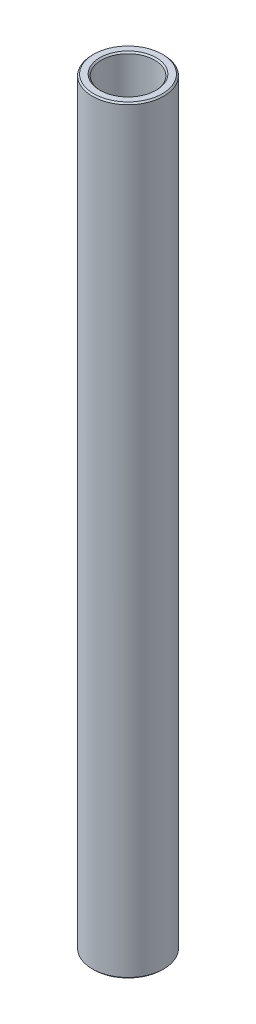
ISO-10303-21;
HEADER;
FILE_DESCRIPTION(('STEP AP214'),'2;1');
FILE_NAME('part.step','',(''),(''),'','','');
FILE_SCHEMA(('AUTOMOTIVE_DESIGN { 1 0 10303 214 1 1 1 1 }'));
ENDSEC;
DATA;
#1=APPLICATION_CONTEXT('core data for automotive mechanical design processes');
#2=APPLICATION_PROTOCOL_DEFINITION('international standard','automotive_design',2000,#1);
#3=PRODUCT_CONTEXT('',#1,'mechanical');
#4=PRODUCT('Part','Part','',(#3));
#5=PRODUCT_RELATED_PRODUCT_CATEGORY('part','',(#4));
#6=PRODUCT_DEFINITION_FORMATION('','',#4);
#7=PRODUCT_DEFINITION_CONTEXT('part definition',#1,'design');
#8=PRODUCT_DEFINITION('design','',#6,#7);
#9=PRODUCT_DEFINITION_SHAPE('','',#8);
#10=(LENGTH_UNIT() NAMED_UNIT(*) SI_UNIT(.MILLI.,.METRE.));
#11=(NAMED_UNIT(*) PLANE_ANGLE_UNIT() SI_UNIT($,.RADIAN.));
#12=(NAMED_UNIT(*) SI_UNIT($,.STERADIAN.) SOLID_ANGLE_UNIT());
#13=UNCERTAINTY_MEASURE_WITH_UNIT(LENGTH_MEASURE(1.E-05),#10,'distance_accuracy_value','');
#14=(GEOMETRIC_REPRESENTATION_CONTEXT(3) GLOBAL_UNCERTAINTY_ASSIGNED_CONTEXT((#13)) GLOBAL_UNIT_ASSIGNED_CONTEXT((#10,
#11,#12)) REPRESENTATION_CONTEXT('',''));
#15=CARTESIAN_POINT('',(0.,0.,0.));
#16=DIRECTION('',(0.,0.,1.));
#17=DIRECTION('',(1.,0.,0.));
#18=AXIS2_PLACEMENT_3D('',#15,#16,#17);
#19=CARTESIAN_POINT('',(6.35000000000028,131.762389929627,0.));
#20=DIRECTION('',(0.,-1.,0.));
#21=DIRECTION('',(1.,0.,0.));
#22=AXIS2_PLACEMENT_3D('',#19,#20,#21);
#23=PLANE('',#22);
#24=CARTESIAN_POINT('',(0.,131.762389929627,0.));
#25=DIRECTION('',(0.,-1.,0.));
#26=DIRECTION('',(1.,0.,0.));
#27=AXIS2_PLACEMENT_3D('',#24,#25,#26);
#28=CIRCLE('',#27,5.01649999999998);
#29=CARTESIAN_POINT('',(5.01649999999997,131.762389929627,0.));
#30=VERTEX_POINT('',#29);
#31=EDGE_CURVE('E10',#30,#30,#28,.F.);
#32=ORIENTED_EDGE('',*,*,#31,.T.);
#33=EDGE_LOOP('',(#32));
#34=FACE_BOUND('',#33,.T.);
#35=CARTESIAN_POINT('',(0.,131.762389929627,0.));
#36=DIRECTION('',(0.,-1.,0.));
#37=DIRECTION('',(1.,0.,0.));
#38=AXIS2_PLACEMENT_3D('',#35,#36,#37);
#39=CIRCLE('',#38,6.09600000000031);
#40=CARTESIAN_POINT('',(6.0960000000003,131.762389929627,0.));
#41=VERTEX_POINT('',#40);
#42=EDGE_CURVE('E37',#41,#41,#39,.T.);
#43=ORIENTED_EDGE('',*,*,#42,.T.);
#44=EDGE_LOOP('',(#43));
#45=FACE_BOUND('',#44,.T.);
#46=ADVANCED_FACE('F30',(#34,#45),#23,.T.);
#47=CARTESIAN_POINT('',(0.,122.237389929627,0.));
#48=DIRECTION('',(0.,-1.,0.));
#49=DIRECTION('',(1.,0.,0.));
#50=AXIS2_PLACEMENT_3D('',#47,#48,#49);
#51=CYLINDRICAL_SURFACE('',#50,4.76250000000011);
#52=CARTESIAN_POINT('',(-1.81950710277241E-13,266.446336963922,0.));
#53=DIRECTION('',(0.,1.,0.));
#54=DIRECTION('',(-1.,0.,0.));
#55=AXIS2_PLACEMENT_3D('',#52,#53,#54);
#56=CIRCLE('',#55,4.76250000000011);
#57=CARTESIAN_POINT('',(-4.76250000000029,266.446336963922,0.));
#58=VERTEX_POINT('',#57);
#59=EDGE_CURVE('E41',#58,#58,#56,.T.);
#60=ORIENTED_EDGE('',*,*,#59,.T.);
#61=EDGE_LOOP('',(#60));
#62=FACE_BOUND('',#61,.T.);
#63=CARTESIAN_POINT('',(0.,132.016389929627,0.));
#64=DIRECTION('',(0.,-1.,0.));
#65=DIRECTION('',(1.,0.,0.));
#66=AXIS2_PLACEMENT_3D('',#63,#64,#65);
#67=CIRCLE('',#66,4.76250000000011);
#68=CARTESIAN_POINT('',(4.7625000000001,132.016389929627,0.));
#69=VERTEX_POINT('',#68);
#70=EDGE_CURVE('E45',#69,#69,#67,.T.);
#71=ORIENTED_EDGE('',*,*,#70,.T.);
#72=EDGE_LOOP('',(#71));
#73=FACE_BOUND('',#72,.T.);
#74=ADVANCED_FACE('F74',(#62,#73),#51,.F.);
#75=CARTESIAN_POINT('',(4.76250000000001,266.700336963923,0.));
#76=DIRECTION('',(0.,1.,0.));
#77=DIRECTION('',(-1.,0.,0.));
#78=AXIS2_PLACEMENT_3D('',#75,#76,#77);
#79=PLANE('',#78);
#80=CARTESIAN_POINT('',(-1.82271186096259E-13,266.700336963923,0.));
#81=DIRECTION('',(0.,1.,0.));
#82=DIRECTION('',(-1.,0.,0.));
#83=AXIS2_PLACEMENT_3D('',#80,#81,#82);
#84=CIRCLE('',#83,6.09600000000047);
#85=CARTESIAN_POINT('',(-6.09600000000066,266.700336963923,0.));
#86=VERTEX_POINT('',#85);
#87=EDGE_CURVE('E50',#86,#86,#84,.T.);
#88=ORIENTED_EDGE('',*,*,#87,.T.);
#89=EDGE_LOOP('',(#88));
#90=FACE_BOUND('',#89,.T.);
#91=CARTESIAN_POINT('',(-1.82271186096259E-13,266.700336963923,0.));
#92=DIRECTION('',(0.,1.,0.));
#93=DIRECTION('',(-1.,0.,0.));
#94=AXIS2_PLACEMENT_3D('',#91,#92,#93);
#95=CIRCLE('',#94,5.01650000000016);
#96=CARTESIAN_POINT('',(-5.01650000000034,266.700336963923,0.));
#97=VERTEX_POINT('',#96);
#98=EDGE_CURVE('E53',#97,#97,#95,.F.);
#99=ORIENTED_EDGE('',*,*,#98,.T.);
#100=EDGE_LOOP('',(#99));
#101=FACE_BOUND('',#100,.T.);
#102=ADVANCED_FACE('F79',(#90,#101),#79,.T.);
#103=CARTESIAN_POINT('',(0.,122.237389929627,0.));
#104=DIRECTION('',(0.,-1.,0.));
#105=DIRECTION('',(1.,0.,0.));
#106=AXIS2_PLACEMENT_3D('',#103,#104,#105);
#107=CYLINDRICAL_SURFACE('',#106,6.35000000000038);
#108=CARTESIAN_POINT('',(-1.81950710277242E-13,266.446336963923,0.));
#109=DIRECTION('',(0.,1.,0.));
#110=DIRECTION('',(-1.,0.,0.));
#111=AXIS2_PLACEMENT_3D('',#108,#109,#110);
#112=CIRCLE('',#111,6.35000000000038);
#113=CARTESIAN_POINT('',(-6.35000000000056,266.446336963923,0.));
#114=VERTEX_POINT('',#113);
#115=EDGE_CURVE('E56',#114,#114,#112,.F.);
#116=ORIENTED_EDGE('',*,*,#115,.T.);
#117=EDGE_LOOP('',(#116));
#118=FACE_BOUND('',#117,.T.);
#119=CARTESIAN_POINT('',(0.,132.016389929627,0.));
#120=DIRECTION('',(0.,-1.,0.));
#121=DIRECTION('',(1.,0.,0.));
#122=AXIS2_PLACEMENT_3D('',#119,#120,#121);
#123=CIRCLE('',#122,6.35000000000038);
#124=CARTESIAN_POINT('',(6.35000000000037,132.016389929627,0.));
#125=VERTEX_POINT('',#124);
#126=EDGE_CURVE('E59',#125,#125,#123,.F.);
#127=ORIENTED_EDGE('',*,*,#126,.T.);
#128=EDGE_LOOP('',(#127));
#129=FACE_BOUND('',#128,.T.);
#130=ADVANCED_FACE('F63',(#118,#129),#107,.T.);
#131=CARTESIAN_POINT('',(-1.81950710277242E-13,266.446336963923,0.));
#132=DIRECTION('',(0.,-1.,0.));
#133=DIRECTION('',(1.,0.,0.));
#134=AXIS2_PLACEMENT_3D('',#131,#132,#133);
#135=CONICAL_SURFACE('',#134,6.35000000000038,0.785398163397426);
#136=ORIENTED_EDGE('',*,*,#87,.F.);
#137=EDGE_LOOP('',(#136));
#138=FACE_BOUND('',#137,.T.);
#139=ORIENTED_EDGE('',*,*,#115,.F.);
#140=EDGE_LOOP('',(#139));
#141=FACE_BOUND('',#140,.T.);
#142=ADVANCED_FACE('F84',(#138,#141),#135,.T.);
#143=CARTESIAN_POINT('',(-1.82271186096259E-13,266.700336963923,0.));
#144=DIRECTION('',(0.,1.,0.));
#145=DIRECTION('',(-1.,0.,0.));
#146=AXIS2_PLACEMENT_3D('',#143,#144,#145);
#147=CONICAL_SURFACE('',#146,5.01650000000017,0.785398163397389);
#148=ORIENTED_EDGE('',*,*,#59,.F.);
#149=EDGE_LOOP('',(#148));
#150=FACE_BOUND('',#149,.T.);
#151=ORIENTED_EDGE('',*,*,#98,.F.);
#152=EDGE_LOOP('',(#151));
#153=FACE_BOUND('',#152,.T.);
#154=ADVANCED_FACE('F71',(#150,#153),#147,.F.);
#155=CARTESIAN_POINT('',(0.,132.016389929627,0.));
#156=DIRECTION('',(0.,-1.,0.));
#157=DIRECTION('',(1.,0.,0.));
#158=AXIS2_PLACEMENT_3D('',#155,#156,#157);
#159=CONICAL_SURFACE('',#158,4.76250000000011,0.785398163397389);
#160=ORIENTED_EDGE('',*,*,#31,.F.);
#161=EDGE_LOOP('',(#160));
#162=FACE_BOUND('',#161,.T.);
#163=ORIENTED_EDGE('',*,*,#70,.F.);
#164=EDGE_LOOP('',(#163));
#165=FACE_BOUND('',#164,.T.);
#166=ADVANCED_FACE('F67',(#162,#165),#159,.F.);
#167=CARTESIAN_POINT('',(0.,131.762389929627,0.));
#168=DIRECTION('',(0.,1.,0.));
#169=DIRECTION('',(-1.,0.,0.));
#170=AXIS2_PLACEMENT_3D('',#167,#168,#169);
#171=CONICAL_SURFACE('',#170,6.09600000000032,0.78539816339745);
#172=ORIENTED_EDGE('',*,*,#126,.F.);
#173=EDGE_LOOP('',(#172));
#174=FACE_BOUND('',#173,.T.);
#175=ORIENTED_EDGE('',*,*,#42,.F.);
#176=EDGE_LOOP('',(#175));
#177=FACE_BOUND('',#176,.T.);
#178=ADVANCED_FACE('F32',(#174,#177),#171,.T.);
#179=CLOSED_SHELL('',(#46,#74,#102,#130,#142,#154,#166,#178));
#180=MANIFOLD_SOLID_BREP('B2',#179);
#181=ADVANCED_BREP_SHAPE_REPRESENTATION('',(#18,#180),#14);
#182=SHAPE_DEFINITION_REPRESENTATION(#9,#181);
ENDSEC;
END-ISO-10303-21;
